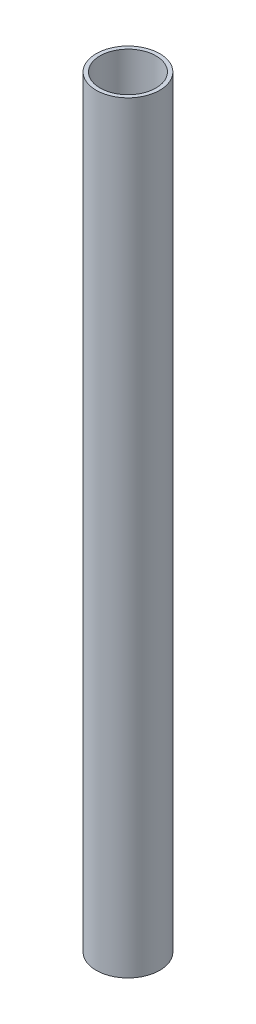
ISO-10303-21;
HEADER;
FILE_DESCRIPTION(('STEP AP214'),'2;1');
FILE_NAME('part.step','',(''),(''),'','','');
FILE_SCHEMA(('AUTOMOTIVE_DESIGN { 1 0 10303 214 1 1 1 1 }'));
ENDSEC;
DATA;
#1=APPLICATION_CONTEXT('core data for automotive mechanical design processes');
#2=APPLICATION_PROTOCOL_DEFINITION('international standard','automotive_design',2000,#1);
#3=PRODUCT_CONTEXT('',#1,'mechanical');
#4=PRODUCT('Part','Part','',(#3));
#5=PRODUCT_RELATED_PRODUCT_CATEGORY('part','',(#4));
#6=PRODUCT_DEFINITION_FORMATION('','',#4);
#7=PRODUCT_DEFINITION_CONTEXT('part definition',#1,'design');
#8=PRODUCT_DEFINITION('design','',#6,#7);
#9=PRODUCT_DEFINITION_SHAPE('','',#8);
#10=(LENGTH_UNIT() NAMED_UNIT(*) SI_UNIT(.MILLI.,.METRE.));
#11=(NAMED_UNIT(*) PLANE_ANGLE_UNIT() SI_UNIT($,.RADIAN.));
#12=(NAMED_UNIT(*) SI_UNIT($,.STERADIAN.) SOLID_ANGLE_UNIT());
#13=UNCERTAINTY_MEASURE_WITH_UNIT(LENGTH_MEASURE(1.E-05),#10,'distance_accuracy_value','');
#14=(GEOMETRIC_REPRESENTATION_CONTEXT(3) GLOBAL_UNCERTAINTY_ASSIGNED_CONTEXT((#13)) GLOBAL_UNIT_ASSIGNED_CONTEXT((#10,
#11,#12)) REPRESENTATION_CONTEXT('',''));
#15=CARTESIAN_POINT('',(0.,0.,0.));
#16=DIRECTION('',(0.,0.,1.));
#17=DIRECTION('',(1.,0.,0.));
#18=AXIS2_PLACEMENT_3D('',#15,#16,#17);
#19=CARTESIAN_POINT('',(0.,152.4,0.));
#20=DIRECTION('',(0.,1.,0.));
#21=DIRECTION('',(0.,0.,1.));
#22=AXIS2_PLACEMENT_3D('',#19,#20,#21);
#23=PLANE('',#22);
#24=CARTESIAN_POINT('',(0.,152.4,0.));
#25=DIRECTION('',(0.,1.,0.));
#26=DIRECTION('',(0.,0.,1.));
#27=AXIS2_PLACEMENT_3D('',#24,#25,#26);
#28=CIRCLE('',#27,6.35);
#29=CARTESIAN_POINT('',(0.,152.4,6.35));
#30=VERTEX_POINT('',#29);
#31=EDGE_CURVE('E10',#30,#30,#28,.T.);
#32=ORIENTED_EDGE('',*,*,#31,.T.);
#33=EDGE_LOOP('',(#32));
#34=FACE_BOUND('',#33,.T.);
#35=CARTESIAN_POINT('',(0.,152.4,0.));
#36=DIRECTION('',(0.,1.,0.));
#37=DIRECTION('',(0.,0.,1.));
#38=AXIS2_PLACEMENT_3D('',#35,#36,#37);
#39=CIRCLE('',#38,5.588);
#40=CARTESIAN_POINT('',(0.,152.4,5.588));
#41=VERTEX_POINT('',#40);
#42=EDGE_CURVE('E42',#41,#41,#39,.T.);
#43=ORIENTED_EDGE('',*,*,#42,.F.);
#44=EDGE_LOOP('',(#43));
#45=FACE_BOUND('',#44,.T.);
#46=ADVANCED_FACE('F31',(#34,#45),#23,.T.);
#47=CARTESIAN_POINT('',(0.,0.,0.));
#48=DIRECTION('',(0.,1.,0.));
#49=DIRECTION('',(0.,0.,1.));
#50=AXIS2_PLACEMENT_3D('',#47,#48,#49);
#51=PLANE('',#50);
#52=CARTESIAN_POINT('',(0.,0.,0.));
#53=DIRECTION('',(0.,1.,0.));
#54=DIRECTION('',(0.,0.,1.));
#55=AXIS2_PLACEMENT_3D('',#52,#53,#54);
#56=CIRCLE('',#55,6.35);
#57=CARTESIAN_POINT('',(0.,0.,6.35));
#58=VERTEX_POINT('',#57);
#59=EDGE_CURVE('E35',#58,#58,#56,.T.);
#60=ORIENTED_EDGE('',*,*,#59,.F.);
#61=EDGE_LOOP('',(#60));
#62=FACE_BOUND('',#61,.T.);
#63=CARTESIAN_POINT('',(0.,0.,0.));
#64=DIRECTION('',(0.,1.,0.));
#65=DIRECTION('',(0.,0.,1.));
#66=AXIS2_PLACEMENT_3D('',#63,#64,#65);
#67=CIRCLE('',#66,5.588);
#68=CARTESIAN_POINT('',(0.,0.,5.588));
#69=VERTEX_POINT('',#68);
#70=EDGE_CURVE('E44',#69,#69,#67,.T.);
#71=ORIENTED_EDGE('',*,*,#70,.T.);
#72=EDGE_LOOP('',(#71));
#73=FACE_BOUND('',#72,.T.);
#74=ADVANCED_FACE('F54',(#62,#73),#51,.F.);
#75=CARTESIAN_POINT('',(0.,152.4,0.));
#76=DIRECTION('',(0.,-1.,0.));
#77=DIRECTION('',(0.,0.,-1.));
#78=AXIS2_PLACEMENT_3D('',#75,#76,#77);
#79=CYLINDRICAL_SURFACE('',#78,6.35);
#80=ORIENTED_EDGE('',*,*,#31,.F.);
#81=EDGE_LOOP('',(#80));
#82=FACE_BOUND('',#81,.T.);
#83=ORIENTED_EDGE('',*,*,#59,.T.);
#84=EDGE_LOOP('',(#83));
#85=FACE_BOUND('',#84,.T.);
#86=ADVANCED_FACE('F33',(#82,#85),#79,.T.);
#87=CARTESIAN_POINT('',(0.,152.4,0.));
#88=DIRECTION('',(0.,-1.,0.));
#89=DIRECTION('',(0.,0.,-1.));
#90=AXIS2_PLACEMENT_3D('',#87,#88,#89);
#91=CYLINDRICAL_SURFACE('',#90,5.588);
#92=ORIENTED_EDGE('',*,*,#42,.T.);
#93=EDGE_LOOP('',(#92));
#94=FACE_BOUND('',#93,.T.);
#95=ORIENTED_EDGE('',*,*,#70,.F.);
#96=EDGE_LOOP('',(#95));
#97=FACE_BOUND('',#96,.T.);
#98=ADVANCED_FACE('F50',(#94,#97),#91,.F.);
#99=CLOSED_SHELL('',(#46,#74,#86,#98));
#100=MANIFOLD_SOLID_BREP('B2',#99);
#101=ADVANCED_BREP_SHAPE_REPRESENTATION('',(#18,#100),#14);
#102=SHAPE_DEFINITION_REPRESENTATION(#9,#101);
ENDSEC;
END-ISO-10303-21;
